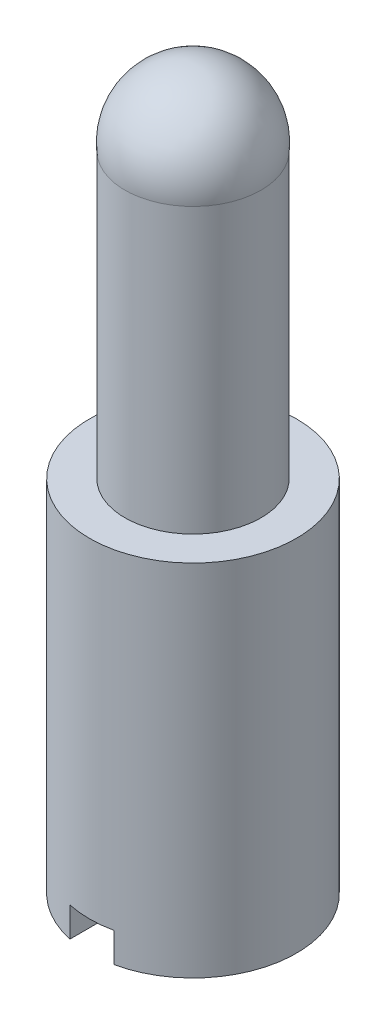
ISO-10303-21;
HEADER;
FILE_DESCRIPTION(('STEP AP214'),'2;1');
FILE_NAME('part.step','',(''),(''),'','','');
FILE_SCHEMA(('AUTOMOTIVE_DESIGN { 1 0 10303 214 1 1 1 1 }'));
ENDSEC;
DATA;
#1=APPLICATION_CONTEXT('core data for automotive mechanical design processes');
#2=APPLICATION_PROTOCOL_DEFINITION('international standard','automotive_design',2000,#1);
#3=PRODUCT_CONTEXT('',#1,'mechanical');
#4=PRODUCT('Part','Part','',(#3));
#5=PRODUCT_RELATED_PRODUCT_CATEGORY('part','',(#4));
#6=PRODUCT_DEFINITION_FORMATION('','',#4);
#7=PRODUCT_DEFINITION_CONTEXT('part definition',#1,'design');
#8=PRODUCT_DEFINITION('design','',#6,#7);
#9=PRODUCT_DEFINITION_SHAPE('','',#8);
#10=(LENGTH_UNIT() NAMED_UNIT(*) SI_UNIT(.MILLI.,.METRE.));
#11=(NAMED_UNIT(*) PLANE_ANGLE_UNIT() SI_UNIT($,.RADIAN.));
#12=(NAMED_UNIT(*) SI_UNIT($,.STERADIAN.) SOLID_ANGLE_UNIT());
#13=UNCERTAINTY_MEASURE_WITH_UNIT(LENGTH_MEASURE(1.E-05),#10,'distance_accuracy_value','');
#14=(GEOMETRIC_REPRESENTATION_CONTEXT(3) GLOBAL_UNCERTAINTY_ASSIGNED_CONTEXT((#13)) GLOBAL_UNIT_ASSIGNED_CONTEXT((#10,
#11,#12)) REPRESENTATION_CONTEXT('',''));
#15=CARTESIAN_POINT('',(0.,0.,0.));
#16=DIRECTION('',(0.,0.,1.));
#17=DIRECTION('',(1.,0.,0.));
#18=AXIS2_PLACEMENT_3D('',#15,#16,#17);
#19=CARTESIAN_POINT('',(0.,0.,0.));
#20=DIRECTION('',(0.,-1.,0.));
#21=DIRECTION('',(0.,0.,-1.));
#22=AXIS2_PLACEMENT_3D('',#19,#20,#21);
#23=PLANE('',#22);
#24=DIRECTION('',(0.,0.,1.));
#25=VECTOR('',#24,1.);
#26=CARTESIAN_POINT('',(-0.5842,0.,-2.7432));
#27=LINE('',#26,#25);
#28=CARTESIAN_POINT('',(-0.5842,0.,-2.68027173995474));
#29=VERTEX_POINT('',#28);
#30=CARTESIAN_POINT('',(-0.5842,0.,2.68027173995474));
#31=VERTEX_POINT('',#30);
#32=EDGE_CURVE('E98',#29,#31,#27,.T.);
#33=ORIENTED_EDGE('',*,*,#32,.T.);
#34=CARTESIAN_POINT('',(0.,0.,0.));
#35=DIRECTION('',(0.,-1.,0.));
#36=DIRECTION('',(0.,0.,-1.));
#37=AXIS2_PLACEMENT_3D('',#34,#35,#36);
#38=CIRCLE('',#37,2.7432);
#39=EDGE_CURVE('E104',#31,#29,#38,.T.);
#40=ORIENTED_EDGE('',*,*,#39,.T.);
#41=EDGE_LOOP('',(#33,#40));
#42=FACE_BOUND('',#41,.T.);
#43=ADVANCED_FACE('F43',(#42),#23,.T.);
#44=DIRECTION('',(0.,0.,1.));
#45=VECTOR('',#44,1.);
#46=CARTESIAN_POINT('',(0.5842,0.,-2.7432));
#47=LINE('',#46,#45);
#48=CARTESIAN_POINT('',(0.5842,0.,-2.68027173995474));
#49=VERTEX_POINT('',#48);
#50=CARTESIAN_POINT('',(0.5842,0.,2.68027173995474));
#51=VERTEX_POINT('',#50);
#52=EDGE_CURVE('E87',#49,#51,#47,.T.);
#53=ORIENTED_EDGE('',*,*,#52,.F.);
#54=EDGE_CURVE('E96',#49,#51,#38,.T.);
#55=ORIENTED_EDGE('',*,*,#54,.T.);
#56=EDGE_LOOP('',(#53,#55));
#57=FACE_BOUND('',#56,.T.);
#58=ADVANCED_FACE('F45',(#57),#23,.T.);
#59=CARTESIAN_POINT('',(0.,0.,0.));
#60=DIRECTION('',(0.,-1.,0.));
#61=DIRECTION('',(0.,0.,-1.));
#62=AXIS2_PLACEMENT_3D('',#59,#60,#61);
#63=CYLINDRICAL_SURFACE('',#62,2.7432);
#64=DIRECTION('',(0.,-1.,0.));
#65=VECTOR('',#64,1.);
#66=CARTESIAN_POINT('',(-0.5842,0.,-2.68027173995474));
#67=LINE('',#66,#65);
#68=CARTESIAN_POINT('',(-0.5842,0.7874,-2.68027173995474));
#69=VERTEX_POINT('',#68);
#70=EDGE_CURVE('E11',#29,#69,#67,.F.);
#71=ORIENTED_EDGE('',*,*,#70,.F.);
#72=ORIENTED_EDGE('',*,*,#39,.F.);
#73=DIRECTION('',(0.,-1.,0.));
#74=VECTOR('',#73,1.);
#75=CARTESIAN_POINT('',(-0.5842,0.,2.68027173995474));
#76=LINE('',#75,#74);
#77=CARTESIAN_POINT('',(-0.5842,0.7874,2.68027173995474));
#78=VERTEX_POINT('',#77);
#79=EDGE_CURVE('E108',#78,#31,#76,.T.);
#80=ORIENTED_EDGE('',*,*,#79,.F.);
#81=CARTESIAN_POINT('',(0.,0.7874,0.));
#82=DIRECTION('',(0.,1.,0.));
#83=DIRECTION('',(-1.,0.,0.));
#84=AXIS2_PLACEMENT_3D('',#81,#82,#83);
#85=CIRCLE('',#84,2.7432);
#86=CARTESIAN_POINT('',(0.5842,0.7874,2.68027173995474));
#87=VERTEX_POINT('',#86);
#88=EDGE_CURVE('E66',#87,#78,#85,.F.);
#89=ORIENTED_EDGE('',*,*,#88,.F.);
#90=DIRECTION('',(0.,-1.,0.));
#91=VECTOR('',#90,1.);
#92=CARTESIAN_POINT('',(0.5842,0.,2.68027173995474));
#93=LINE('',#92,#91);
#94=EDGE_CURVE('E52',#51,#87,#93,.F.);
#95=ORIENTED_EDGE('',*,*,#94,.F.);
#96=ORIENTED_EDGE('',*,*,#54,.F.);
#97=DIRECTION('',(0.,-1.,0.));
#98=VECTOR('',#97,1.);
#99=CARTESIAN_POINT('',(0.5842,0.,-2.68027173995474));
#100=LINE('',#99,#98);
#101=CARTESIAN_POINT('',(0.5842,0.7874,-2.68027173995474));
#102=VERTEX_POINT('',#101);
#103=EDGE_CURVE('E84',#102,#49,#100,.T.);
#104=ORIENTED_EDGE('',*,*,#103,.F.);
#105=EDGE_CURVE('E92',#69,#102,#85,.F.);
#106=ORIENTED_EDGE('',*,*,#105,.F.);
#107=EDGE_LOOP('',(#71,#72,#80,#89,#95,#96,#104,#106));
#108=FACE_BOUND('',#107,.T.);
#109=CARTESIAN_POINT('',(0.,9.525,0.));
#110=DIRECTION('',(0.,-1.,0.));
#111=DIRECTION('',(0.,0.,-1.));
#112=AXIS2_PLACEMENT_3D('',#109,#110,#111);
#113=CIRCLE('',#112,2.7432);
#114=CARTESIAN_POINT('',(0.,9.525,-2.7432));
#115=VERTEX_POINT('',#114);
#116=EDGE_CURVE('E111',#115,#115,#113,.T.);
#117=ORIENTED_EDGE('',*,*,#116,.T.);
#118=EDGE_LOOP('',(#117));
#119=FACE_BOUND('',#118,.T.);
#120=ADVANCED_FACE('F101',(#108,#119),#63,.T.);
#121=CARTESIAN_POINT('',(2.7432,9.525,0.));
#122=DIRECTION('',(0.,1.,0.));
#123=DIRECTION('',(0.,0.,1.));
#124=AXIS2_PLACEMENT_3D('',#121,#122,#123);
#125=PLANE('',#124);
#126=CARTESIAN_POINT('',(0.,9.525,0.));
#127=DIRECTION('',(0.,-1.,0.));
#128=DIRECTION('',(0.,0.,-1.));
#129=AXIS2_PLACEMENT_3D('',#126,#127,#128);
#130=CIRCLE('',#129,1.8034);
#131=CARTESIAN_POINT('',(0.,9.525,-1.8034));
#132=VERTEX_POINT('',#131);
#133=EDGE_CURVE('E130',#132,#132,#130,.T.);
#134=ORIENTED_EDGE('',*,*,#133,.T.);
#135=EDGE_LOOP('',(#134));
#136=FACE_BOUND('',#135,.T.);
#137=ORIENTED_EDGE('',*,*,#116,.F.);
#138=EDGE_LOOP('',(#137));
#139=FACE_BOUND('',#138,.T.);
#140=ADVANCED_FACE('F139',(#136,#139),#125,.T.);
#141=CARTESIAN_POINT('',(0.,0.,0.));
#142=DIRECTION('',(0.,-1.,0.));
#143=DIRECTION('',(0.,0.,-1.));
#144=AXIS2_PLACEMENT_3D('',#141,#142,#143);
#145=CYLINDRICAL_SURFACE('',#144,1.8034);
#146=CARTESIAN_POINT('',(0.,17.0458017667656,0.));
#147=DIRECTION('',(0.,-1.,0.));
#148=DIRECTION('',(0.,0.,-1.));
#149=AXIS2_PLACEMENT_3D('',#146,#147,#148);
#150=CIRCLE('',#149,1.8034);
#151=CARTESIAN_POINT('',(0.,17.0458017667656,-1.8034));
#152=VERTEX_POINT('',#151);
#153=EDGE_CURVE('E122',#152,#152,#150,.T.);
#154=ORIENTED_EDGE('',*,*,#153,.T.);
#155=EDGE_LOOP('',(#154));
#156=FACE_BOUND('',#155,.T.);
#157=ORIENTED_EDGE('',*,*,#133,.F.);
#158=EDGE_LOOP('',(#157));
#159=FACE_BOUND('',#158,.T.);
#160=ADVANCED_FACE('F141',(#156,#159),#145,.T.);
#161=CARTESIAN_POINT('',(0.,17.2365411321192,0.));
#162=DIRECTION('',(0.,-1.,0.));
#163=DIRECTION('',(1.,0.,0.));
#164=AXIS2_PLACEMENT_3D('',#161,#162,#163);
#165=SPHERICAL_SURFACE('',#164,1.81345886788079);
#166=ORIENTED_EDGE('',*,*,#153,.F.);
#167=EDGE_LOOP('',(#166));
#168=FACE_BOUND('',#167,.T.);
#169=ADVANCED_FACE('F147',(#168),#165,.T.);
#170=CARTESIAN_POINT('',(-0.5842,0.,-2.7432));
#171=DIRECTION('',(-1.,0.,0.));
#172=DIRECTION('',(0.,0.,1.));
#173=AXIS2_PLACEMENT_3D('',#170,#171,#172);
#174=PLANE('',#173);
#175=ORIENTED_EDGE('',*,*,#70,.T.);
#176=DIRECTION('',(0.,0.,1.));
#177=VECTOR('',#176,1.);
#178=CARTESIAN_POINT('',(-0.5842,0.7874,-2.7432));
#179=LINE('',#178,#177);
#180=EDGE_CURVE('E119',#69,#78,#179,.T.);
#181=ORIENTED_EDGE('',*,*,#180,.T.);
#182=ORIENTED_EDGE('',*,*,#79,.T.);
#183=ORIENTED_EDGE('',*,*,#32,.F.);
#184=EDGE_LOOP('',(#175,#181,#182,#183));
#185=FACE_BOUND('',#184,.T.);
#186=ADVANCED_FACE('F158',(#185),#174,.F.);
#187=CARTESIAN_POINT('',(-0.5842,0.7874,-2.7432));
#188=DIRECTION('',(0.,1.,0.));
#189=DIRECTION('',(-1.,0.,0.));
#190=AXIS2_PLACEMENT_3D('',#187,#188,#189);
#191=PLANE('',#190);
#192=ORIENTED_EDGE('',*,*,#180,.F.);
#193=ORIENTED_EDGE('',*,*,#105,.T.);
#194=DIRECTION('',(0.,0.,1.));
#195=VECTOR('',#194,1.);
#196=CARTESIAN_POINT('',(0.5842,0.7874,-2.7432));
#197=LINE('',#196,#195);
#198=EDGE_CURVE('E59',#102,#87,#197,.T.);
#199=ORIENTED_EDGE('',*,*,#198,.T.);
#200=ORIENTED_EDGE('',*,*,#88,.T.);
#201=EDGE_LOOP('',(#192,#193,#199,#200));
#202=FACE_BOUND('',#201,.T.);
#203=ADVANCED_FACE('F117',(#202),#191,.F.);
#204=CARTESIAN_POINT('',(0.5842,0.,-2.7432));
#205=DIRECTION('',(1.,0.,0.));
#206=DIRECTION('',(0.,0.,-1.));
#207=AXIS2_PLACEMENT_3D('',#204,#205,#206);
#208=PLANE('',#207);
#209=ORIENTED_EDGE('',*,*,#94,.T.);
#210=ORIENTED_EDGE('',*,*,#198,.F.);
#211=ORIENTED_EDGE('',*,*,#103,.T.);
#212=ORIENTED_EDGE('',*,*,#52,.T.);
#213=EDGE_LOOP('',(#209,#210,#211,#212));
#214=FACE_BOUND('',#213,.T.);
#215=ADVANCED_FACE('F86',(#214),#208,.F.);
#216=CLOSED_SHELL('',(#43,#58,#120,#140,#160,#169,#186,#203,#215));
#217=MANIFOLD_SOLID_BREP('B2',#216);
#218=ADVANCED_BREP_SHAPE_REPRESENTATION('',(#18,#217),#14);
#219=SHAPE_DEFINITION_REPRESENTATION(#9,#218);
ENDSEC;
END-ISO-10303-21;
